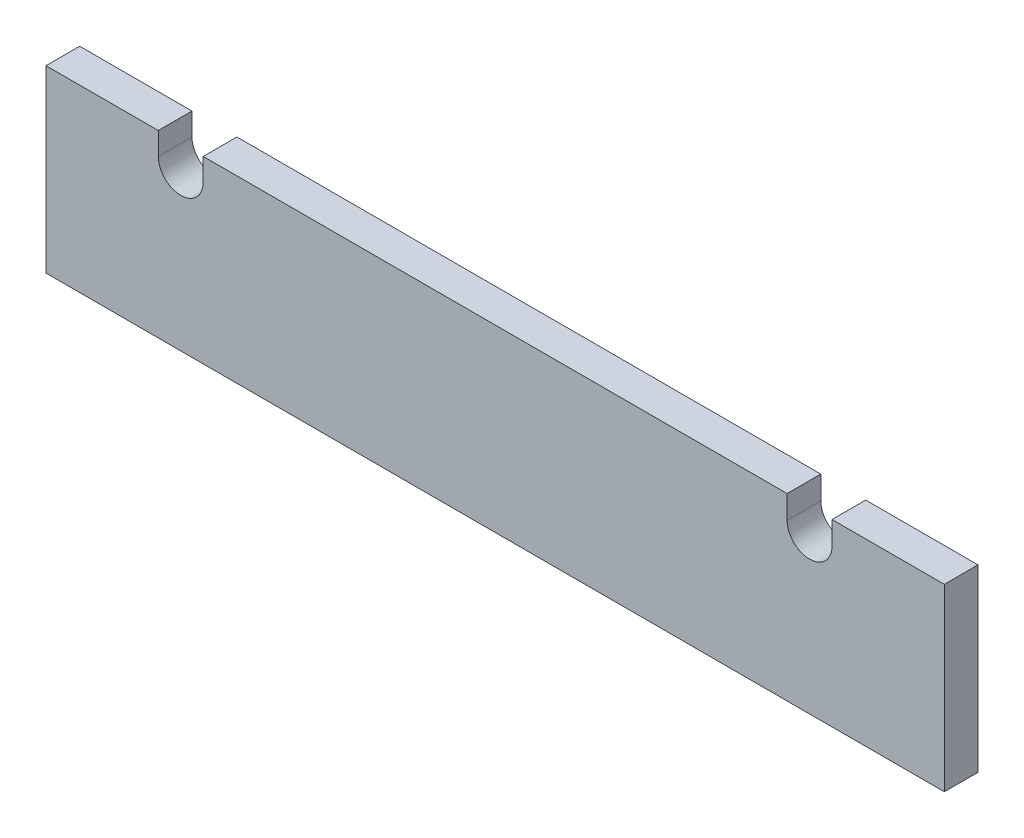
ISO-10303-21;
HEADER;
FILE_DESCRIPTION(('STEP AP214'),'2;1');
FILE_NAME('part.step','',(''),(''),'','','');
FILE_SCHEMA(('AUTOMOTIVE_DESIGN { 1 0 10303 214 1 1 1 1 }'));
ENDSEC;
DATA;
#1=APPLICATION_CONTEXT('core data for automotive mechanical design processes');
#2=APPLICATION_PROTOCOL_DEFINITION('international standard','automotive_design',2000,#1);
#3=PRODUCT_CONTEXT('',#1,'mechanical');
#4=PRODUCT('Part','Part','',(#3));
#5=PRODUCT_RELATED_PRODUCT_CATEGORY('part','',(#4));
#6=PRODUCT_DEFINITION_FORMATION('','',#4);
#7=PRODUCT_DEFINITION_CONTEXT('part definition',#1,'design');
#8=PRODUCT_DEFINITION('design','',#6,#7);
#9=PRODUCT_DEFINITION_SHAPE('','',#8);
#10=(LENGTH_UNIT() NAMED_UNIT(*) SI_UNIT(.MILLI.,.METRE.));
#11=(NAMED_UNIT(*) PLANE_ANGLE_UNIT() SI_UNIT($,.RADIAN.));
#12=(NAMED_UNIT(*) SI_UNIT($,.STERADIAN.) SOLID_ANGLE_UNIT());
#13=UNCERTAINTY_MEASURE_WITH_UNIT(LENGTH_MEASURE(1.E-05),#10,'distance_accuracy_value','');
#14=(GEOMETRIC_REPRESENTATION_CONTEXT(3) GLOBAL_UNCERTAINTY_ASSIGNED_CONTEXT((#13)) GLOBAL_UNIT_ASSIGNED_CONTEXT((#10,
#11,#12)) REPRESENTATION_CONTEXT('',''));
#15=CARTESIAN_POINT('',(0.,0.,0.));
#16=DIRECTION('',(0.,0.,1.));
#17=DIRECTION('',(1.,0.,0.));
#18=AXIS2_PLACEMENT_3D('',#15,#16,#17);
#19=CARTESIAN_POINT('',(431.8,88.5400059083107,19.05));
#20=DIRECTION('',(0.,0.,-1.));
#21=DIRECTION('',(-1.,0.,0.));
#22=AXIS2_PLACEMENT_3D('',#19,#20,#21);
#23=CYLINDRICAL_SURFACE('',#22,12.7);
#24=CARTESIAN_POINT('',(431.8,88.5400059083107,0.));
#25=DIRECTION('',(0.,0.,1.));
#26=DIRECTION('',(1.,0.,0.));
#27=AXIS2_PLACEMENT_3D('',#24,#25,#26);
#28=CIRCLE('',#27,12.7);
#29=CARTESIAN_POINT('',(419.1,88.5400059083107,0.));
#30=VERTEX_POINT('',#29);
#31=CARTESIAN_POINT('',(444.5,88.5400059083107,0.));
#32=VERTEX_POINT('',#31);
#33=EDGE_CURVE('E216',#30,#32,#28,.T.);
#34=ORIENTED_EDGE('',*,*,#33,.F.);
#35=DIRECTION('',(0.,0.,-1.));
#36=VECTOR('',#35,1.);
#37=CARTESIAN_POINT('',(419.1,88.5400059083107,19.05));
#38=LINE('',#37,#36);
#39=CARTESIAN_POINT('',(419.1,88.5400059083107,19.05));
#40=VERTEX_POINT('',#39);
#41=EDGE_CURVE('E11',#40,#30,#38,.T.);
#42=ORIENTED_EDGE('',*,*,#41,.F.);
#43=CARTESIAN_POINT('',(431.8,88.5400059083107,19.05));
#44=DIRECTION('',(0.,0.,1.));
#45=DIRECTION('',(1.,0.,0.));
#46=AXIS2_PLACEMENT_3D('',#43,#44,#45);
#47=CIRCLE('',#46,12.7);
#48=CARTESIAN_POINT('',(444.5,88.5400059083107,19.05));
#49=VERTEX_POINT('',#48);
#50=EDGE_CURVE('E178',#40,#49,#47,.T.);
#51=ORIENTED_EDGE('',*,*,#50,.T.);
#52=DIRECTION('',(0.,0.,-1.));
#53=VECTOR('',#52,1.);
#54=CARTESIAN_POINT('',(444.5,88.5400059083107,19.05));
#55=LINE('',#54,#53);
#56=EDGE_CURVE('E99',#49,#32,#55,.T.);
#57=ORIENTED_EDGE('',*,*,#56,.T.);
#58=EDGE_LOOP('',(#34,#42,#51,#57));
#59=FACE_BOUND('',#58,.T.);
#60=ADVANCED_FACE('F37',(#59),#23,.F.);
#61=CARTESIAN_POINT('',(419.1,0.,19.05));
#62=DIRECTION('',(1.,0.,0.));
#63=DIRECTION('',(0.,0.,-1.));
#64=AXIS2_PLACEMENT_3D('',#61,#62,#63);
#65=PLANE('',#64);
#66=DIRECTION('',(0.,-1.,0.));
#67=VECTOR('',#66,1.);
#68=CARTESIAN_POINT('',(419.1,0.,0.));
#69=LINE('',#68,#67);
#70=CARTESIAN_POINT('',(419.1,101.6,0.));
#71=VERTEX_POINT('',#70);
#72=EDGE_CURVE('E213',#71,#30,#69,.T.);
#73=ORIENTED_EDGE('',*,*,#72,.F.);
#74=DIRECTION('',(0.,0.,-1.));
#75=VECTOR('',#74,1.);
#76=CARTESIAN_POINT('',(419.1,101.6,19.05));
#77=LINE('',#76,#75);
#78=CARTESIAN_POINT('',(419.1,101.6,19.05));
#79=VERTEX_POINT('',#78);
#80=EDGE_CURVE('E45',#79,#71,#77,.T.);
#81=ORIENTED_EDGE('',*,*,#80,.F.);
#82=DIRECTION('',(0.,-1.,0.));
#83=VECTOR('',#82,1.);
#84=CARTESIAN_POINT('',(419.1,0.,19.05));
#85=LINE('',#84,#83);
#86=EDGE_CURVE('E175',#79,#40,#85,.T.);
#87=ORIENTED_EDGE('',*,*,#86,.T.);
#88=ORIENTED_EDGE('',*,*,#41,.T.);
#89=EDGE_LOOP('',(#73,#81,#87,#88));
#90=FACE_BOUND('',#89,.T.);
#91=ADVANCED_FACE('F214',(#90),#65,.T.);
#92=CARTESIAN_POINT('',(0.,101.6,19.05));
#93=DIRECTION('',(0.,1.,0.));
#94=DIRECTION('',(0.,0.,1.));
#95=AXIS2_PLACEMENT_3D('',#92,#93,#94);
#96=PLANE('',#95);
#97=DIRECTION('',(1.,0.,0.));
#98=VECTOR('',#97,1.);
#99=CARTESIAN_POINT('',(0.,101.6,0.));
#100=LINE('',#99,#98);
#101=CARTESIAN_POINT('',(88.9000000000001,101.6,0.));
#102=VERTEX_POINT('',#101);
#103=EDGE_CURVE('E207',#102,#71,#100,.T.);
#104=ORIENTED_EDGE('',*,*,#103,.F.);
#105=DIRECTION('',(0.,0.,-1.));
#106=VECTOR('',#105,1.);
#107=CARTESIAN_POINT('',(88.9000000000001,101.6,19.05));
#108=LINE('',#107,#106);
#109=CARTESIAN_POINT('',(88.9000000000001,101.6,19.05));
#110=VERTEX_POINT('',#109);
#111=EDGE_CURVE('E201',#110,#102,#108,.T.);
#112=ORIENTED_EDGE('',*,*,#111,.F.);
#113=DIRECTION('',(1.,0.,0.));
#114=VECTOR('',#113,1.);
#115=CARTESIAN_POINT('',(0.,101.6,19.05));
#116=LINE('',#115,#114);
#117=EDGE_CURVE('E172',#110,#79,#116,.T.);
#118=ORIENTED_EDGE('',*,*,#117,.T.);
#119=ORIENTED_EDGE('',*,*,#80,.T.);
#120=EDGE_LOOP('',(#104,#112,#118,#119));
#121=FACE_BOUND('',#120,.T.);
#122=ADVANCED_FACE('F205',(#121),#96,.T.);
#123=CARTESIAN_POINT('',(88.9000000000001,0.,19.05));
#124=DIRECTION('',(-1.,0.,0.));
#125=DIRECTION('',(0.,0.,1.));
#126=AXIS2_PLACEMENT_3D('',#123,#124,#125);
#127=PLANE('',#126);
#128=DIRECTION('',(0.,1.,0.));
#129=VECTOR('',#128,1.);
#130=CARTESIAN_POINT('',(88.9000000000001,0.,0.));
#131=LINE('',#130,#129);
#132=CARTESIAN_POINT('',(88.9000000000001,88.9,0.));
#133=VERTEX_POINT('',#132);
#134=EDGE_CURVE('E221',#133,#102,#131,.T.);
#135=ORIENTED_EDGE('',*,*,#134,.F.);
#136=DIRECTION('',(0.,0.,-1.));
#137=VECTOR('',#136,1.);
#138=CARTESIAN_POINT('',(88.9000000000001,88.9,19.05));
#139=LINE('',#138,#137);
#140=CARTESIAN_POINT('',(88.9000000000001,88.9,19.05));
#141=VERTEX_POINT('',#140);
#142=EDGE_CURVE('E199',#141,#133,#139,.T.);
#143=ORIENTED_EDGE('',*,*,#142,.F.);
#144=DIRECTION('',(0.,1.,0.));
#145=VECTOR('',#144,1.);
#146=CARTESIAN_POINT('',(88.9000000000001,0.,19.05));
#147=LINE('',#146,#145);
#148=EDGE_CURVE('E167',#141,#110,#147,.T.);
#149=ORIENTED_EDGE('',*,*,#148,.T.);
#150=ORIENTED_EDGE('',*,*,#111,.T.);
#151=EDGE_LOOP('',(#135,#143,#149,#150));
#152=FACE_BOUND('',#151,.T.);
#153=ADVANCED_FACE('F247',(#152),#127,.T.);
#154=CARTESIAN_POINT('',(76.2000000000001,88.9,19.05));
#155=DIRECTION('',(0.,0.,-1.));
#156=DIRECTION('',(-1.,0.,0.));
#157=AXIS2_PLACEMENT_3D('',#154,#155,#156);
#158=CYLINDRICAL_SURFACE('',#157,12.7);
#159=CARTESIAN_POINT('',(76.2000000000001,88.9,0.));
#160=DIRECTION('',(0.,0.,1.));
#161=DIRECTION('',(1.,0.,0.));
#162=AXIS2_PLACEMENT_3D('',#159,#160,#161);
#163=CIRCLE('',#162,12.7);
#164=CARTESIAN_POINT('',(63.5000000000001,88.9,0.));
#165=VERTEX_POINT('',#164);
#166=EDGE_CURVE('E223',#165,#133,#163,.T.);
#167=ORIENTED_EDGE('',*,*,#166,.F.);
#168=DIRECTION('',(0.,0.,-1.));
#169=VECTOR('',#168,1.);
#170=CARTESIAN_POINT('',(63.5000000000001,88.9,19.05));
#171=LINE('',#170,#169);
#172=CARTESIAN_POINT('',(63.5000000000001,88.9,19.05));
#173=VERTEX_POINT('',#172);
#174=EDGE_CURVE('E197',#173,#165,#171,.T.);
#175=ORIENTED_EDGE('',*,*,#174,.F.);
#176=CARTESIAN_POINT('',(76.2000000000001,88.9,19.05));
#177=DIRECTION('',(0.,0.,1.));
#178=DIRECTION('',(1.,0.,0.));
#179=AXIS2_PLACEMENT_3D('',#176,#177,#178);
#180=CIRCLE('',#179,12.7);
#181=EDGE_CURVE('E162',#173,#141,#180,.T.);
#182=ORIENTED_EDGE('',*,*,#181,.T.);
#183=ORIENTED_EDGE('',*,*,#142,.T.);
#184=EDGE_LOOP('',(#167,#175,#182,#183));
#185=FACE_BOUND('',#184,.T.);
#186=ADVANCED_FACE('F252',(#185),#158,.F.);
#187=CARTESIAN_POINT('',(63.5000000000001,0.,19.05));
#188=DIRECTION('',(-1.,0.,0.));
#189=DIRECTION('',(0.,0.,1.));
#190=AXIS2_PLACEMENT_3D('',#187,#188,#189);
#191=PLANE('',#190);
#192=DIRECTION('',(0.,1.,0.));
#193=VECTOR('',#192,1.);
#194=CARTESIAN_POINT('',(63.5000000000001,0.,0.));
#195=LINE('',#194,#193);
#196=CARTESIAN_POINT('',(63.5000000000001,101.6,0.));
#197=VERTEX_POINT('',#196);
#198=EDGE_CURVE('E228',#165,#197,#195,.T.);
#199=ORIENTED_EDGE('',*,*,#198,.T.);
#200=DIRECTION('',(0.,0.,-1.));
#201=VECTOR('',#200,1.);
#202=CARTESIAN_POINT('',(63.5000000000001,101.6,19.05));
#203=LINE('',#202,#201);
#204=CARTESIAN_POINT('',(63.5000000000001,101.6,19.05));
#205=VERTEX_POINT('',#204);
#206=EDGE_CURVE('E195',#205,#197,#203,.T.);
#207=ORIENTED_EDGE('',*,*,#206,.F.);
#208=DIRECTION('',(0.,1.,0.));
#209=VECTOR('',#208,1.);
#210=CARTESIAN_POINT('',(63.5000000000001,0.,19.05));
#211=LINE('',#210,#209);
#212=EDGE_CURVE('E158',#173,#205,#211,.T.);
#213=ORIENTED_EDGE('',*,*,#212,.F.);
#214=ORIENTED_EDGE('',*,*,#174,.T.);
#215=EDGE_LOOP('',(#199,#207,#213,#214));
#216=FACE_BOUND('',#215,.T.);
#217=ADVANCED_FACE('F256',(#216),#191,.F.);
#218=CARTESIAN_POINT('',(0.,101.6,19.05));
#219=DIRECTION('',(0.,1.,0.));
#220=DIRECTION('',(0.,0.,1.));
#221=AXIS2_PLACEMENT_3D('',#218,#219,#220);
#222=PLANE('',#221);
#223=DIRECTION('',(1.,0.,0.));
#224=VECTOR('',#223,1.);
#225=CARTESIAN_POINT('',(0.,101.6,0.));
#226=LINE('',#225,#224);
#227=CARTESIAN_POINT('',(0.,101.6,0.));
#228=VERTEX_POINT('',#227);
#229=EDGE_CURVE('E184',#228,#197,#226,.T.);
#230=ORIENTED_EDGE('',*,*,#229,.F.);
#231=DIRECTION('',(0.,0.,-1.));
#232=VECTOR('',#231,1.);
#233=CARTESIAN_POINT('',(0.,101.6,19.05));
#234=LINE('',#233,#232);
#235=CARTESIAN_POINT('',(0.,101.6,19.05));
#236=VERTEX_POINT('',#235);
#237=EDGE_CURVE('E193',#236,#228,#234,.T.);
#238=ORIENTED_EDGE('',*,*,#237,.F.);
#239=DIRECTION('',(1.,0.,0.));
#240=VECTOR('',#239,1.);
#241=CARTESIAN_POINT('',(0.,101.6,19.05));
#242=LINE('',#241,#240);
#243=EDGE_CURVE('E152',#236,#205,#242,.T.);
#244=ORIENTED_EDGE('',*,*,#243,.T.);
#245=ORIENTED_EDGE('',*,*,#206,.T.);
#246=EDGE_LOOP('',(#230,#238,#244,#245));
#247=FACE_BOUND('',#246,.T.);
#248=ADVANCED_FACE('F260',(#247),#222,.T.);
#249=CARTESIAN_POINT('',(0.,0.,19.05));
#250=DIRECTION('',(-1.,0.,0.));
#251=DIRECTION('',(0.,0.,1.));
#252=AXIS2_PLACEMENT_3D('',#249,#250,#251);
#253=PLANE('',#252);
#254=DIRECTION('',(0.,1.,0.));
#255=VECTOR('',#254,1.);
#256=CARTESIAN_POINT('',(0.,0.,0.));
#257=LINE('',#256,#255);
#258=CARTESIAN_POINT('',(0.,0.,0.));
#259=VERTEX_POINT('',#258);
#260=EDGE_CURVE('E232',#259,#228,#257,.T.);
#261=ORIENTED_EDGE('',*,*,#260,.F.);
#262=DIRECTION('',(0.,0.,-1.));
#263=VECTOR('',#262,1.);
#264=CARTESIAN_POINT('',(0.,0.,19.05));
#265=LINE('',#264,#263);
#266=CARTESIAN_POINT('',(0.,0.,19.05));
#267=VERTEX_POINT('',#266);
#268=EDGE_CURVE('E191',#267,#259,#265,.T.);
#269=ORIENTED_EDGE('',*,*,#268,.F.);
#270=DIRECTION('',(0.,1.,0.));
#271=VECTOR('',#270,1.);
#272=CARTESIAN_POINT('',(0.,0.,19.05));
#273=LINE('',#272,#271);
#274=EDGE_CURVE('E157',#267,#236,#273,.T.);
#275=ORIENTED_EDGE('',*,*,#274,.T.);
#276=ORIENTED_EDGE('',*,*,#237,.T.);
#277=EDGE_LOOP('',(#261,#269,#275,#276));
#278=FACE_BOUND('',#277,.T.);
#279=ADVANCED_FACE('F262',(#278),#253,.T.);
#280=CARTESIAN_POINT('',(0.,0.,19.05));
#281=DIRECTION('',(0.,1.,0.));
#282=DIRECTION('',(0.,0.,1.));
#283=AXIS2_PLACEMENT_3D('',#280,#281,#282);
#284=PLANE('',#283);
#285=DIRECTION('',(1.,0.,0.));
#286=VECTOR('',#285,1.);
#287=CARTESIAN_POINT('',(0.,0.,0.));
#288=LINE('',#287,#286);
#289=CARTESIAN_POINT('',(508.,0.,0.));
#290=VERTEX_POINT('',#289);
#291=EDGE_CURVE('E234',#259,#290,#288,.T.);
#292=ORIENTED_EDGE('',*,*,#291,.T.);
#293=DIRECTION('',(0.,0.,-1.));
#294=VECTOR('',#293,1.);
#295=CARTESIAN_POINT('',(508.,0.,19.05));
#296=LINE('',#295,#294);
#297=CARTESIAN_POINT('',(508.,0.,19.05));
#298=VERTEX_POINT('',#297);
#299=EDGE_CURVE('E148',#298,#290,#296,.T.);
#300=ORIENTED_EDGE('',*,*,#299,.F.);
#301=DIRECTION('',(1.,0.,0.));
#302=VECTOR('',#301,1.);
#303=CARTESIAN_POINT('',(0.,0.,19.05));
#304=LINE('',#303,#302);
#305=EDGE_CURVE('E135',#267,#298,#304,.T.);
#306=ORIENTED_EDGE('',*,*,#305,.F.);
#307=ORIENTED_EDGE('',*,*,#268,.T.);
#308=EDGE_LOOP('',(#292,#300,#306,#307));
#309=FACE_BOUND('',#308,.T.);
#310=ADVANCED_FACE('F237',(#309),#284,.F.);
#311=CARTESIAN_POINT('',(508.,0.,19.05));
#312=DIRECTION('',(-1.,0.,0.));
#313=DIRECTION('',(0.,0.,1.));
#314=AXIS2_PLACEMENT_3D('',#311,#312,#313);
#315=PLANE('',#314);
#316=DIRECTION('',(0.,1.,0.));
#317=VECTOR('',#316,1.);
#318=CARTESIAN_POINT('',(508.,0.,0.));
#319=LINE('',#318,#317);
#320=CARTESIAN_POINT('',(508.,101.6,0.));
#321=VERTEX_POINT('',#320);
#322=EDGE_CURVE('E144',#290,#321,#319,.T.);
#323=ORIENTED_EDGE('',*,*,#322,.T.);
#324=DIRECTION('',(0.,0.,-1.));
#325=VECTOR('',#324,1.);
#326=CARTESIAN_POINT('',(508.,101.6,19.05));
#327=LINE('',#326,#325);
#328=CARTESIAN_POINT('',(508.,101.6,19.05));
#329=VERTEX_POINT('',#328);
#330=EDGE_CURVE('E141',#329,#321,#327,.T.);
#331=ORIENTED_EDGE('',*,*,#330,.F.);
#332=DIRECTION('',(0.,1.,0.));
#333=VECTOR('',#332,1.);
#334=CARTESIAN_POINT('',(508.,0.,19.05));
#335=LINE('',#334,#333);
#336=EDGE_CURVE('E128',#298,#329,#335,.T.);
#337=ORIENTED_EDGE('',*,*,#336,.F.);
#338=ORIENTED_EDGE('',*,*,#299,.T.);
#339=EDGE_LOOP('',(#323,#331,#337,#338));
#340=FACE_BOUND('',#339,.T.);
#341=ADVANCED_FACE('F142',(#340),#315,.F.);
#342=CARTESIAN_POINT('',(444.5,101.6,0.));
#343=VERTEX_POINT('',#342);
#344=EDGE_CURVE('E180',#343,#321,#226,.T.);
#345=ORIENTED_EDGE('',*,*,#344,.F.);
#346=DIRECTION('',(0.,0.,-1.));
#347=VECTOR('',#346,1.);
#348=CARTESIAN_POINT('',(444.5,101.6,19.05));
#349=LINE('',#348,#347);
#350=CARTESIAN_POINT('',(444.5,101.6,19.05));
#351=VERTEX_POINT('',#350);
#352=EDGE_CURVE('E92',#351,#343,#349,.T.);
#353=ORIENTED_EDGE('',*,*,#352,.F.);
#354=EDGE_CURVE('E132',#351,#329,#242,.T.);
#355=ORIENTED_EDGE('',*,*,#354,.T.);
#356=ORIENTED_EDGE('',*,*,#330,.T.);
#357=EDGE_LOOP('',(#345,#353,#355,#356));
#358=FACE_BOUND('',#357,.T.);
#359=ADVANCED_FACE('F150',(#358),#222,.T.);
#360=CARTESIAN_POINT('',(444.5,0.,19.05));
#361=DIRECTION('',(1.,0.,0.));
#362=DIRECTION('',(0.,0.,-1.));
#363=AXIS2_PLACEMENT_3D('',#360,#361,#362);
#364=PLANE('',#363);
#365=DIRECTION('',(0.,-1.,0.));
#366=VECTOR('',#365,1.);
#367=CARTESIAN_POINT('',(444.5,0.,0.));
#368=LINE('',#367,#366);
#369=EDGE_CURVE('E179',#343,#32,#368,.T.);
#370=ORIENTED_EDGE('',*,*,#369,.T.);
#371=ORIENTED_EDGE('',*,*,#56,.F.);
#372=DIRECTION('',(0.,-1.,0.));
#373=VECTOR('',#372,1.);
#374=CARTESIAN_POINT('',(444.5,0.,19.05));
#375=LINE('',#374,#373);
#376=EDGE_CURVE('E53',#351,#49,#375,.T.);
#377=ORIENTED_EDGE('',*,*,#376,.F.);
#378=ORIENTED_EDGE('',*,*,#352,.T.);
#379=EDGE_LOOP('',(#370,#371,#377,#378));
#380=FACE_BOUND('',#379,.T.);
#381=ADVANCED_FACE('F272',(#380),#364,.F.);
#382=CARTESIAN_POINT('',(0.,0.,19.05));
#383=DIRECTION('',(0.,0.,1.));
#384=DIRECTION('',(1.,0.,0.));
#385=AXIS2_PLACEMENT_3D('',#382,#383,#384);
#386=PLANE('',#385);
#387=ORIENTED_EDGE('',*,*,#50,.F.);
#388=ORIENTED_EDGE('',*,*,#86,.F.);
#389=ORIENTED_EDGE('',*,*,#117,.F.);
#390=ORIENTED_EDGE('',*,*,#148,.F.);
#391=ORIENTED_EDGE('',*,*,#181,.F.);
#392=ORIENTED_EDGE('',*,*,#212,.T.);
#393=ORIENTED_EDGE('',*,*,#243,.F.);
#394=ORIENTED_EDGE('',*,*,#274,.F.);
#395=ORIENTED_EDGE('',*,*,#305,.T.);
#396=ORIENTED_EDGE('',*,*,#336,.T.);
#397=ORIENTED_EDGE('',*,*,#354,.F.);
#398=ORIENTED_EDGE('',*,*,#376,.T.);
#399=EDGE_LOOP('',(#387,#388,#389,#390,#391,#392,#393,#394,#395,#396,#397,#398));
#400=FACE_BOUND('',#399,.T.);
#401=ADVANCED_FACE('F130',(#400),#386,.T.);
#402=CARTESIAN_POINT('',(0.,0.,0.));
#403=DIRECTION('',(0.,0.,1.));
#404=DIRECTION('',(1.,0.,0.));
#405=AXIS2_PLACEMENT_3D('',#402,#403,#404);
#406=PLANE('',#405);
#407=ORIENTED_EDGE('',*,*,#33,.T.);
#408=ORIENTED_EDGE('',*,*,#369,.F.);
#409=ORIENTED_EDGE('',*,*,#344,.T.);
#410=ORIENTED_EDGE('',*,*,#322,.F.);
#411=ORIENTED_EDGE('',*,*,#291,.F.);
#412=ORIENTED_EDGE('',*,*,#260,.T.);
#413=ORIENTED_EDGE('',*,*,#229,.T.);
#414=ORIENTED_EDGE('',*,*,#198,.F.);
#415=ORIENTED_EDGE('',*,*,#166,.T.);
#416=ORIENTED_EDGE('',*,*,#134,.T.);
#417=ORIENTED_EDGE('',*,*,#103,.T.);
#418=ORIENTED_EDGE('',*,*,#72,.T.);
#419=EDGE_LOOP('',(#407,#408,#409,#410,#411,#412,#413,#414,#415,#416,#417,#418));
#420=FACE_BOUND('',#419,.T.);
#421=ADVANCED_FACE('F218',(#420),#406,.F.);
#422=CLOSED_SHELL('',(#60,#91,#122,#153,#186,#217,#248,#279,#310,#341,#359,#381,#401,#421));
#423=MANIFOLD_SOLID_BREP('B2',#422);
#424=ADVANCED_BREP_SHAPE_REPRESENTATION('',(#18,#423),#14);
#425=SHAPE_DEFINITION_REPRESENTATION(#9,#424);
ENDSEC;
END-ISO-10303-21;
